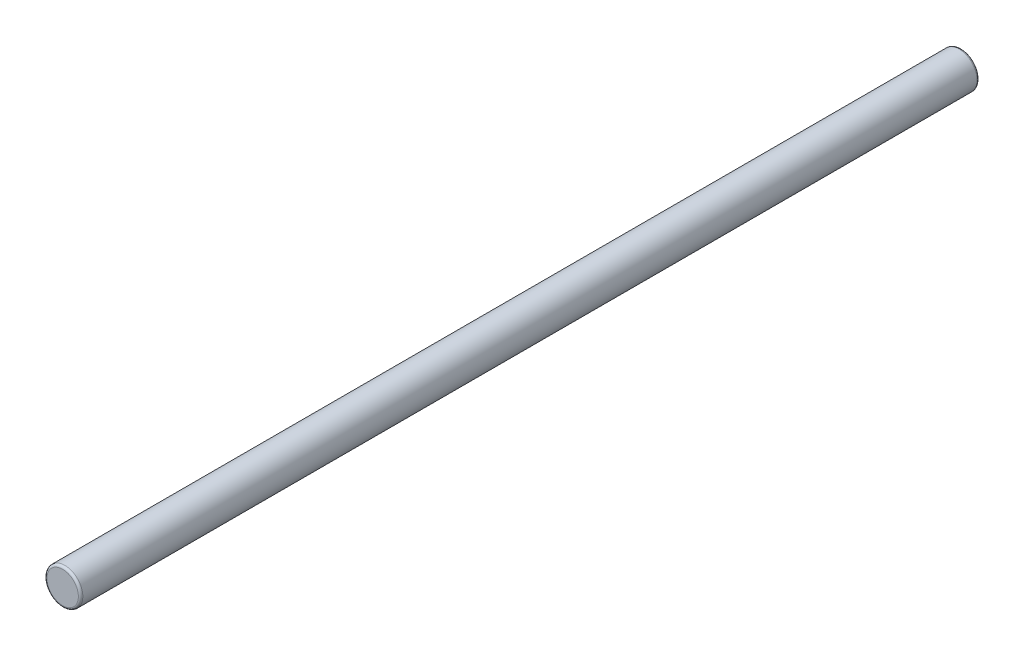
ISO-10303-21;
HEADER;
FILE_DESCRIPTION(('STEP AP214'),'2;1');
FILE_NAME('part.step','',(''),(''),'','','');
FILE_SCHEMA(('AUTOMOTIVE_DESIGN { 1 0 10303 214 1 1 1 1 }'));
ENDSEC;
DATA;
#1=APPLICATION_CONTEXT('core data for automotive mechanical design processes');
#2=APPLICATION_PROTOCOL_DEFINITION('international standard','automotive_design',2000,#1);
#3=PRODUCT_CONTEXT('',#1,'mechanical');
#4=PRODUCT('Part','Part','',(#3));
#5=PRODUCT_RELATED_PRODUCT_CATEGORY('part','',(#4));
#6=PRODUCT_DEFINITION_FORMATION('','',#4);
#7=PRODUCT_DEFINITION_CONTEXT('part definition',#1,'design');
#8=PRODUCT_DEFINITION('design','',#6,#7);
#9=PRODUCT_DEFINITION_SHAPE('','',#8);
#10=(LENGTH_UNIT() NAMED_UNIT(*) SI_UNIT(.MILLI.,.METRE.));
#11=(NAMED_UNIT(*) PLANE_ANGLE_UNIT() SI_UNIT($,.RADIAN.));
#12=(NAMED_UNIT(*) SI_UNIT($,.STERADIAN.) SOLID_ANGLE_UNIT());
#13=UNCERTAINTY_MEASURE_WITH_UNIT(LENGTH_MEASURE(1.E-05),#10,'distance_accuracy_value','');
#14=(GEOMETRIC_REPRESENTATION_CONTEXT(3) GLOBAL_UNCERTAINTY_ASSIGNED_CONTEXT((#13)) GLOBAL_UNIT_ASSIGNED_CONTEXT((#10,
#11,#12)) REPRESENTATION_CONTEXT('',''));
#15=CARTESIAN_POINT('',(0.,0.,0.));
#16=DIRECTION('',(0.,0.,1.));
#17=DIRECTION('',(1.,0.,0.));
#18=AXIS2_PLACEMENT_3D('',#15,#16,#17);
#19=CARTESIAN_POINT('',(0.,0.,200.));
#20=DIRECTION('',(0.,0.,-1.));
#21=DIRECTION('',(-1.,0.,0.));
#22=AXIS2_PLACEMENT_3D('',#19,#20,#21);
#23=CYLINDRICAL_SURFACE('',#22,4.);
#24=CARTESIAN_POINT('',(0.,0.,0.5));
#25=DIRECTION('',(0.,0.,1.));
#26=DIRECTION('',(1.,0.,0.));
#27=AXIS2_PLACEMENT_3D('',#24,#25,#26);
#28=CIRCLE('',#27,4.);
#29=CARTESIAN_POINT('',(4.,0.,0.5));
#30=VERTEX_POINT('',#29);
#31=EDGE_CURVE('E48',#30,#30,#28,.T.);
#32=ORIENTED_EDGE('',*,*,#31,.T.);
#33=EDGE_LOOP('',(#32));
#34=FACE_BOUND('',#33,.T.);
#35=CARTESIAN_POINT('',(0.,0.,199.5));
#36=DIRECTION('',(0.,0.,1.));
#37=DIRECTION('',(1.,0.,0.));
#38=AXIS2_PLACEMENT_3D('',#35,#36,#37);
#39=CIRCLE('',#38,4.);
#40=CARTESIAN_POINT('',(4.,0.,199.5));
#41=VERTEX_POINT('',#40);
#42=EDGE_CURVE('E53',#41,#41,#39,.F.);
#43=ORIENTED_EDGE('',*,*,#42,.T.);
#44=EDGE_LOOP('',(#43));
#45=FACE_BOUND('',#44,.T.);
#46=ADVANCED_FACE('F34',(#34,#45),#23,.T.);
#47=CARTESIAN_POINT('',(0.,0.,200.));
#48=DIRECTION('',(0.,0.,1.));
#49=DIRECTION('',(1.,0.,0.));
#50=AXIS2_PLACEMENT_3D('',#47,#48,#49);
#51=PLANE('',#50);
#52=CARTESIAN_POINT('',(0.,0.,200.));
#53=DIRECTION('',(0.,0.,1.));
#54=DIRECTION('',(1.,0.,0.));
#55=AXIS2_PLACEMENT_3D('',#52,#53,#54);
#56=CIRCLE('',#55,3.5);
#57=CARTESIAN_POINT('',(3.5,0.,200.));
#58=VERTEX_POINT('',#57);
#59=EDGE_CURVE('E10',#58,#58,#56,.T.);
#60=ORIENTED_EDGE('',*,*,#59,.T.);
#61=EDGE_LOOP('',(#60));
#62=FACE_BOUND('',#61,.T.);
#63=ADVANCED_FACE('F69',(#62),#51,.T.);
#64=CARTESIAN_POINT('',(0.,0.,0.));
#65=DIRECTION('',(0.,0.,1.));
#66=DIRECTION('',(1.,0.,0.));
#67=AXIS2_PLACEMENT_3D('',#64,#65,#66);
#68=PLANE('',#67);
#69=CARTESIAN_POINT('',(0.,0.,0.));
#70=DIRECTION('',(0.,0.,1.));
#71=DIRECTION('',(1.,0.,0.));
#72=AXIS2_PLACEMENT_3D('',#69,#70,#71);
#73=CIRCLE('',#72,3.5);
#74=CARTESIAN_POINT('',(3.5,0.,0.));
#75=VERTEX_POINT('',#74);
#76=EDGE_CURVE('E42',#75,#75,#73,.F.);
#77=ORIENTED_EDGE('',*,*,#76,.T.);
#78=EDGE_LOOP('',(#77));
#79=FACE_BOUND('',#78,.T.);
#80=ADVANCED_FACE('F66',(#79),#68,.F.);
#81=CARTESIAN_POINT('',(0.,0.,0.5));
#82=DIRECTION('',(0.,0.,1.));
#83=DIRECTION('',(1.,0.,0.));
#84=AXIS2_PLACEMENT_3D('',#81,#82,#83);
#85=TOROIDAL_SURFACE('',#84,3.5,0.5);
#86=ORIENTED_EDGE('',*,*,#76,.F.);
#87=EDGE_LOOP('',(#86));
#88=FACE_BOUND('',#87,.T.);
#89=ORIENTED_EDGE('',*,*,#31,.F.);
#90=EDGE_LOOP('',(#89));
#91=FACE_BOUND('',#90,.T.);
#92=ADVANCED_FACE('F62',(#88,#91),#85,.T.);
#93=CARTESIAN_POINT('',(0.,0.,199.5));
#94=DIRECTION('',(0.,0.,1.));
#95=DIRECTION('',(1.,0.,0.));
#96=AXIS2_PLACEMENT_3D('',#93,#94,#95);
#97=TOROIDAL_SURFACE('',#96,3.5,0.5);
#98=ORIENTED_EDGE('',*,*,#42,.F.);
#99=EDGE_LOOP('',(#98));
#100=FACE_BOUND('',#99,.T.);
#101=ORIENTED_EDGE('',*,*,#59,.F.);
#102=EDGE_LOOP('',(#101));
#103=FACE_BOUND('',#102,.T.);
#104=ADVANCED_FACE('F36',(#100,#103),#97,.T.);
#105=CLOSED_SHELL('',(#46,#63,#80,#92,#104));
#106=MANIFOLD_SOLID_BREP('B2',#105);
#107=ADVANCED_BREP_SHAPE_REPRESENTATION('',(#18,#106),#14);
#108=SHAPE_DEFINITION_REPRESENTATION(#9,#107);
ENDSEC;
END-ISO-10303-21;
